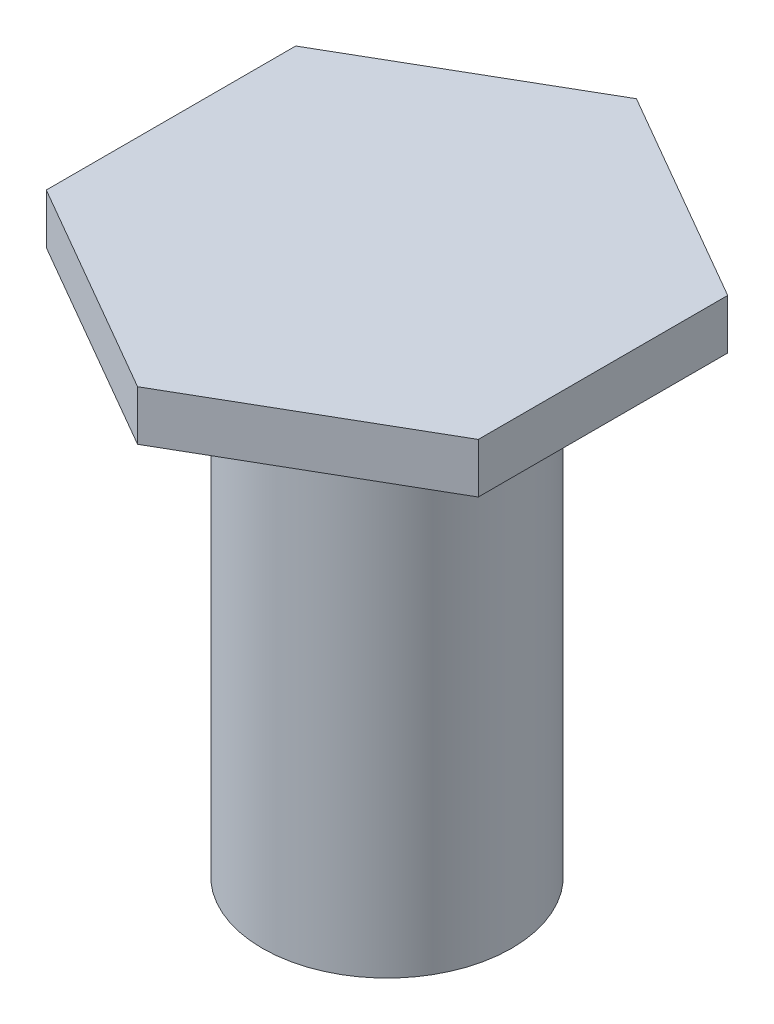
ISO-10303-21;
HEADER;
FILE_DESCRIPTION(('STEP AP214'),'2;1');
FILE_NAME('part.step','',(''),(''),'','','');
FILE_SCHEMA(('AUTOMOTIVE_DESIGN { 1 0 10303 214 1 1 1 1 }'));
ENDSEC;
DATA;
#1=APPLICATION_CONTEXT('core data for automotive mechanical design processes');
#2=APPLICATION_PROTOCOL_DEFINITION('international standard','automotive_design',2000,#1);
#3=PRODUCT_CONTEXT('',#1,'mechanical');
#4=PRODUCT('Part','Part','',(#3));
#5=PRODUCT_RELATED_PRODUCT_CATEGORY('part','',(#4));
#6=PRODUCT_DEFINITION_FORMATION('','',#4);
#7=PRODUCT_DEFINITION_CONTEXT('part definition',#1,'design');
#8=PRODUCT_DEFINITION('design','',#6,#7);
#9=PRODUCT_DEFINITION_SHAPE('','',#8);
#10=(LENGTH_UNIT() NAMED_UNIT(*) SI_UNIT(.MILLI.,.METRE.));
#11=(NAMED_UNIT(*) PLANE_ANGLE_UNIT() SI_UNIT($,.RADIAN.));
#12=(NAMED_UNIT(*) SI_UNIT($,.STERADIAN.) SOLID_ANGLE_UNIT());
#13=UNCERTAINTY_MEASURE_WITH_UNIT(LENGTH_MEASURE(1.E-05),#10,'distance_accuracy_value','');
#14=(GEOMETRIC_REPRESENTATION_CONTEXT(3) GLOBAL_UNCERTAINTY_ASSIGNED_CONTEXT((#13)) GLOBAL_UNIT_ASSIGNED_CONTEXT((#10,
#11,#12)) REPRESENTATION_CONTEXT('',''));
#15=CARTESIAN_POINT('',(0.,0.,0.));
#16=DIRECTION('',(0.,0.,1.));
#17=DIRECTION('',(1.,0.,0.));
#18=AXIS2_PLACEMENT_3D('',#15,#16,#17);
#19=CARTESIAN_POINT('',(0.,20.,0.));
#20=DIRECTION('',(0.,1.,0.));
#21=DIRECTION('',(0.,0.,1.));
#22=AXIS2_PLACEMENT_3D('',#19,#20,#21);
#23=PLANE('',#22);
#24=CARTESIAN_POINT('',(0.,20.,0.));
#25=DIRECTION('',(0.,1.,0.));
#26=DIRECTION('',(0.,0.,1.));
#27=AXIS2_PLACEMENT_3D('',#24,#25,#26);
#28=CIRCLE('',#27,5.);
#29=CARTESIAN_POINT('',(0.,20.,5.));
#30=VERTEX_POINT('',#29);
#31=EDGE_CURVE('E12',#30,#30,#28,.T.);
#32=ORIENTED_EDGE('',*,*,#31,.T.);
#33=EDGE_LOOP('',(#32));
#34=FACE_BOUND('',#33,.T.);
#35=DIRECTION('',(-0.866025403784439,0.,0.5));
#36=VECTOR('',#35,1.);
#37=CARTESIAN_POINT('',(-8.66025403784439,20.,-5.));
#38=LINE('',#37,#36);
#39=CARTESIAN_POINT('',(0.,20.,-10.));
#40=VERTEX_POINT('',#39);
#41=CARTESIAN_POINT('',(-8.66025403784439,20.,-5.));
#42=VERTEX_POINT('',#41);
#43=EDGE_CURVE('E49',#40,#42,#38,.T.);
#44=ORIENTED_EDGE('',*,*,#43,.F.);
#45=DIRECTION('',(-0.866025403784439,0.,-0.5));
#46=VECTOR('',#45,1.);
#47=CARTESIAN_POINT('',(0.,20.,-10.));
#48=LINE('',#47,#46);
#49=CARTESIAN_POINT('',(8.66025403784439,20.,-5.));
#50=VERTEX_POINT('',#49);
#51=EDGE_CURVE('E110',#50,#40,#48,.T.);
#52=ORIENTED_EDGE('',*,*,#51,.F.);
#53=DIRECTION('',(0.,0.,-1.));
#54=VECTOR('',#53,1.);
#55=CARTESIAN_POINT('',(8.66025403784439,20.,-5.));
#56=LINE('',#55,#54);
#57=CARTESIAN_POINT('',(8.66025403784439,20.,5.));
#58=VERTEX_POINT('',#57);
#59=EDGE_CURVE('E108',#58,#50,#56,.T.);
#60=ORIENTED_EDGE('',*,*,#59,.F.);
#61=DIRECTION('',(0.866025403784439,0.,-0.5));
#62=VECTOR('',#61,1.);
#63=CARTESIAN_POINT('',(8.66025403784439,20.,5.));
#64=LINE('',#63,#62);
#65=CARTESIAN_POINT('',(0.,20.,10.));
#66=VERTEX_POINT('',#65);
#67=EDGE_CURVE('E91',#66,#58,#64,.T.);
#68=ORIENTED_EDGE('',*,*,#67,.F.);
#69=DIRECTION('',(0.866025403784439,0.,0.5));
#70=VECTOR('',#69,1.);
#71=CARTESIAN_POINT('',(0.,20.,10.));
#72=LINE('',#71,#70);
#73=CARTESIAN_POINT('',(-8.66025403784439,20.,5.00000000000001));
#74=VERTEX_POINT('',#73);
#75=EDGE_CURVE('E99',#74,#66,#72,.T.);
#76=ORIENTED_EDGE('',*,*,#75,.F.);
#77=DIRECTION('',(0.,0.,1.));
#78=VECTOR('',#77,1.);
#79=CARTESIAN_POINT('',(-8.66025403784439,20.,5.00000000000001));
#80=LINE('',#79,#78);
#81=EDGE_CURVE('E104',#42,#74,#80,.T.);
#82=ORIENTED_EDGE('',*,*,#81,.F.);
#83=EDGE_LOOP('',(#44,#52,#60,#68,#76,#82));
#84=FACE_BOUND('',#83,.T.);
#85=ADVANCED_FACE('F34',(#34,#84),#23,.F.);
#86=CARTESIAN_POINT('',(0.,20.,0.));
#87=DIRECTION('',(0.,-1.,0.));
#88=DIRECTION('',(0.,0.,-1.));
#89=AXIS2_PLACEMENT_3D('',#86,#87,#88);
#90=CYLINDRICAL_SURFACE('',#89,5.);
#91=ORIENTED_EDGE('',*,*,#31,.F.);
#92=EDGE_LOOP('',(#91));
#93=FACE_BOUND('',#92,.T.);
#94=CARTESIAN_POINT('',(0.,0.,0.));
#95=DIRECTION('',(0.,1.,0.));
#96=DIRECTION('',(0.,0.,1.));
#97=AXIS2_PLACEMENT_3D('',#94,#95,#96);
#98=CIRCLE('',#97,5.);
#99=CARTESIAN_POINT('',(0.,0.,5.));
#100=VERTEX_POINT('',#99);
#101=EDGE_CURVE('E38',#100,#100,#98,.T.);
#102=ORIENTED_EDGE('',*,*,#101,.T.);
#103=EDGE_LOOP('',(#102));
#104=FACE_BOUND('',#103,.T.);
#105=ADVANCED_FACE('F36',(#93,#104),#90,.T.);
#106=CARTESIAN_POINT('',(0.,0.,0.));
#107=DIRECTION('',(0.,1.,0.));
#108=DIRECTION('',(0.,0.,1.));
#109=AXIS2_PLACEMENT_3D('',#106,#107,#108);
#110=PLANE('',#109);
#111=ORIENTED_EDGE('',*,*,#101,.F.);
#112=EDGE_LOOP('',(#111));
#113=FACE_BOUND('',#112,.T.);
#114=ADVANCED_FACE('F165',(#113),#110,.F.);
#115=CARTESIAN_POINT('',(-8.66025403784439,20.,-5.));
#116=DIRECTION('',(-0.5,0.,-0.866025403784439));
#117=DIRECTION('',(-0.866025403784439,0.,0.5));
#118=AXIS2_PLACEMENT_3D('',#115,#116,#117);
#119=PLANE('',#118);
#120=DIRECTION('',(-0.866025403784439,0.,0.5));
#121=VECTOR('',#120,1.);
#122=CARTESIAN_POINT('',(-8.66025403784439,22.,-5.));
#123=LINE('',#122,#121);
#124=CARTESIAN_POINT('',(0.,22.,-10.));
#125=VERTEX_POINT('',#124);
#126=CARTESIAN_POINT('',(-8.66025403784439,22.,-5.));
#127=VERTEX_POINT('',#126);
#128=EDGE_CURVE('E117',#125,#127,#123,.T.);
#129=ORIENTED_EDGE('',*,*,#128,.F.);
#130=DIRECTION('',(0.,1.,0.));
#131=VECTOR('',#130,1.);
#132=CARTESIAN_POINT('',(0.,20.,-10.));
#133=LINE('',#132,#131);
#134=EDGE_CURVE('E131',#40,#125,#133,.T.);
#135=ORIENTED_EDGE('',*,*,#134,.F.);
#136=ORIENTED_EDGE('',*,*,#43,.T.);
#137=DIRECTION('',(0.,1.,0.));
#138=VECTOR('',#137,1.);
#139=CARTESIAN_POINT('',(-8.66025403784439,20.,-5.));
#140=LINE('',#139,#138);
#141=EDGE_CURVE('E116',#42,#127,#140,.T.);
#142=ORIENTED_EDGE('',*,*,#141,.T.);
#143=EDGE_LOOP('',(#129,#135,#136,#142));
#144=FACE_BOUND('',#143,.T.);
#145=ADVANCED_FACE('F139',(#144),#119,.T.);
#146=CARTESIAN_POINT('',(0.,20.,-10.));
#147=DIRECTION('',(0.5,0.,-0.866025403784439));
#148=DIRECTION('',(-0.866025403784439,0.,-0.5));
#149=AXIS2_PLACEMENT_3D('',#146,#147,#148);
#150=PLANE('',#149);
#151=DIRECTION('',(-0.866025403784439,0.,-0.5));
#152=VECTOR('',#151,1.);
#153=CARTESIAN_POINT('',(0.,22.,-10.));
#154=LINE('',#153,#152);
#155=CARTESIAN_POINT('',(8.66025403784439,22.,-5.));
#156=VERTEX_POINT('',#155);
#157=EDGE_CURVE('E128',#156,#125,#154,.T.);
#158=ORIENTED_EDGE('',*,*,#157,.F.);
#159=DIRECTION('',(0.,1.,0.));
#160=VECTOR('',#159,1.);
#161=CARTESIAN_POINT('',(8.66025403784439,20.,-5.));
#162=LINE('',#161,#160);
#163=EDGE_CURVE('E133',#50,#156,#162,.T.);
#164=ORIENTED_EDGE('',*,*,#163,.F.);
#165=ORIENTED_EDGE('',*,*,#51,.T.);
#166=ORIENTED_EDGE('',*,*,#134,.T.);
#167=EDGE_LOOP('',(#158,#164,#165,#166));
#168=FACE_BOUND('',#167,.T.);
#169=ADVANCED_FACE('F147',(#168),#150,.T.);
#170=CARTESIAN_POINT('',(8.66025403784439,20.,-5.));
#171=DIRECTION('',(1.,0.,0.));
#172=DIRECTION('',(0.,0.,-1.));
#173=AXIS2_PLACEMENT_3D('',#170,#171,#172);
#174=PLANE('',#173);
#175=DIRECTION('',(0.,0.,-1.));
#176=VECTOR('',#175,1.);
#177=CARTESIAN_POINT('',(8.66025403784439,22.,-5.));
#178=LINE('',#177,#176);
#179=CARTESIAN_POINT('',(8.66025403784439,22.,5.));
#180=VERTEX_POINT('',#179);
#181=EDGE_CURVE('E125',#180,#156,#178,.T.);
#182=ORIENTED_EDGE('',*,*,#181,.F.);
#183=DIRECTION('',(0.,1.,0.));
#184=VECTOR('',#183,1.);
#185=CARTESIAN_POINT('',(8.66025403784439,20.,5.));
#186=LINE('',#185,#184);
#187=EDGE_CURVE('E95',#58,#180,#186,.T.);
#188=ORIENTED_EDGE('',*,*,#187,.F.);
#189=ORIENTED_EDGE('',*,*,#59,.T.);
#190=ORIENTED_EDGE('',*,*,#163,.T.);
#191=EDGE_LOOP('',(#182,#188,#189,#190));
#192=FACE_BOUND('',#191,.T.);
#193=ADVANCED_FACE('F150',(#192),#174,.T.);
#194=CARTESIAN_POINT('',(8.66025403784439,20.,5.));
#195=DIRECTION('',(0.5,0.,0.866025403784439));
#196=DIRECTION('',(0.866025403784439,0.,-0.5));
#197=AXIS2_PLACEMENT_3D('',#194,#195,#196);
#198=PLANE('',#197);
#199=DIRECTION('',(0.866025403784439,0.,-0.5));
#200=VECTOR('',#199,1.);
#201=CARTESIAN_POINT('',(8.66025403784439,22.,5.));
#202=LINE('',#201,#200);
#203=CARTESIAN_POINT('',(0.,22.,10.));
#204=VERTEX_POINT('',#203);
#205=EDGE_CURVE('E94',#204,#180,#202,.T.);
#206=ORIENTED_EDGE('',*,*,#205,.F.);
#207=DIRECTION('',(0.,1.,0.));
#208=VECTOR('',#207,1.);
#209=CARTESIAN_POINT('',(0.,20.,10.));
#210=LINE('',#209,#208);
#211=EDGE_CURVE('E87',#66,#204,#210,.T.);
#212=ORIENTED_EDGE('',*,*,#211,.F.);
#213=ORIENTED_EDGE('',*,*,#67,.T.);
#214=ORIENTED_EDGE('',*,*,#187,.T.);
#215=EDGE_LOOP('',(#206,#212,#213,#214));
#216=FACE_BOUND('',#215,.T.);
#217=ADVANCED_FACE('F89',(#216),#198,.T.);
#218=CARTESIAN_POINT('',(0.,20.,10.));
#219=DIRECTION('',(-0.5,0.,0.866025403784439));
#220=DIRECTION('',(0.866025403784439,0.,0.5));
#221=AXIS2_PLACEMENT_3D('',#218,#219,#220);
#222=PLANE('',#221);
#223=DIRECTION('',(0.866025403784439,0.,0.5));
#224=VECTOR('',#223,1.);
#225=CARTESIAN_POINT('',(0.,22.,10.));
#226=LINE('',#225,#224);
#227=CARTESIAN_POINT('',(-8.66025403784439,22.,5.));
#228=VERTEX_POINT('',#227);
#229=EDGE_CURVE('E57',#228,#204,#226,.T.);
#230=ORIENTED_EDGE('',*,*,#229,.F.);
#231=DIRECTION('',(0.,1.,0.));
#232=VECTOR('',#231,1.);
#233=CARTESIAN_POINT('',(-8.66025403784439,20.,5.00000000000001));
#234=LINE('',#233,#232);
#235=EDGE_CURVE('E96',#74,#228,#234,.T.);
#236=ORIENTED_EDGE('',*,*,#235,.F.);
#237=ORIENTED_EDGE('',*,*,#75,.T.);
#238=ORIENTED_EDGE('',*,*,#211,.T.);
#239=EDGE_LOOP('',(#230,#236,#237,#238));
#240=FACE_BOUND('',#239,.T.);
#241=ADVANCED_FACE('F100',(#240),#222,.T.);
#242=CARTESIAN_POINT('',(-8.66025403784439,20.,5.00000000000001));
#243=DIRECTION('',(-1.,0.,0.));
#244=DIRECTION('',(0.,0.,1.));
#245=AXIS2_PLACEMENT_3D('',#242,#243,#244);
#246=PLANE('',#245);
#247=DIRECTION('',(0.,0.,1.));
#248=VECTOR('',#247,1.);
#249=CARTESIAN_POINT('',(-8.66025403784439,22.,5.00000000000001));
#250=LINE('',#249,#248);
#251=EDGE_CURVE('E120',#127,#228,#250,.T.);
#252=ORIENTED_EDGE('',*,*,#251,.F.);
#253=ORIENTED_EDGE('',*,*,#141,.F.);
#254=ORIENTED_EDGE('',*,*,#81,.T.);
#255=ORIENTED_EDGE('',*,*,#235,.T.);
#256=EDGE_LOOP('',(#252,#253,#254,#255));
#257=FACE_BOUND('',#256,.T.);
#258=ADVANCED_FACE('F141',(#257),#246,.T.);
#259=CARTESIAN_POINT('',(0.,22.,0.));
#260=DIRECTION('',(0.,1.,0.));
#261=DIRECTION('',(0.,0.,1.));
#262=AXIS2_PLACEMENT_3D('',#259,#260,#261);
#263=PLANE('',#262);
#264=ORIENTED_EDGE('',*,*,#157,.T.);
#265=ORIENTED_EDGE('',*,*,#128,.T.);
#266=ORIENTED_EDGE('',*,*,#251,.T.);
#267=ORIENTED_EDGE('',*,*,#229,.T.);
#268=ORIENTED_EDGE('',*,*,#205,.T.);
#269=ORIENTED_EDGE('',*,*,#181,.T.);
#270=EDGE_LOOP('',(#264,#265,#266,#267,#268,#269));
#271=FACE_BOUND('',#270,.T.);
#272=ADVANCED_FACE('F143',(#271),#263,.T.);
#273=CLOSED_SHELL('',(#85,#105,#114,#145,#169,#193,#217,#241,#258,#272));
#274=MANIFOLD_SOLID_BREP('B2',#273);
#275=ADVANCED_BREP_SHAPE_REPRESENTATION('',(#18,#274),#14);
#276=SHAPE_DEFINITION_REPRESENTATION(#9,#275);
ENDSEC;
END-ISO-10303-21;
